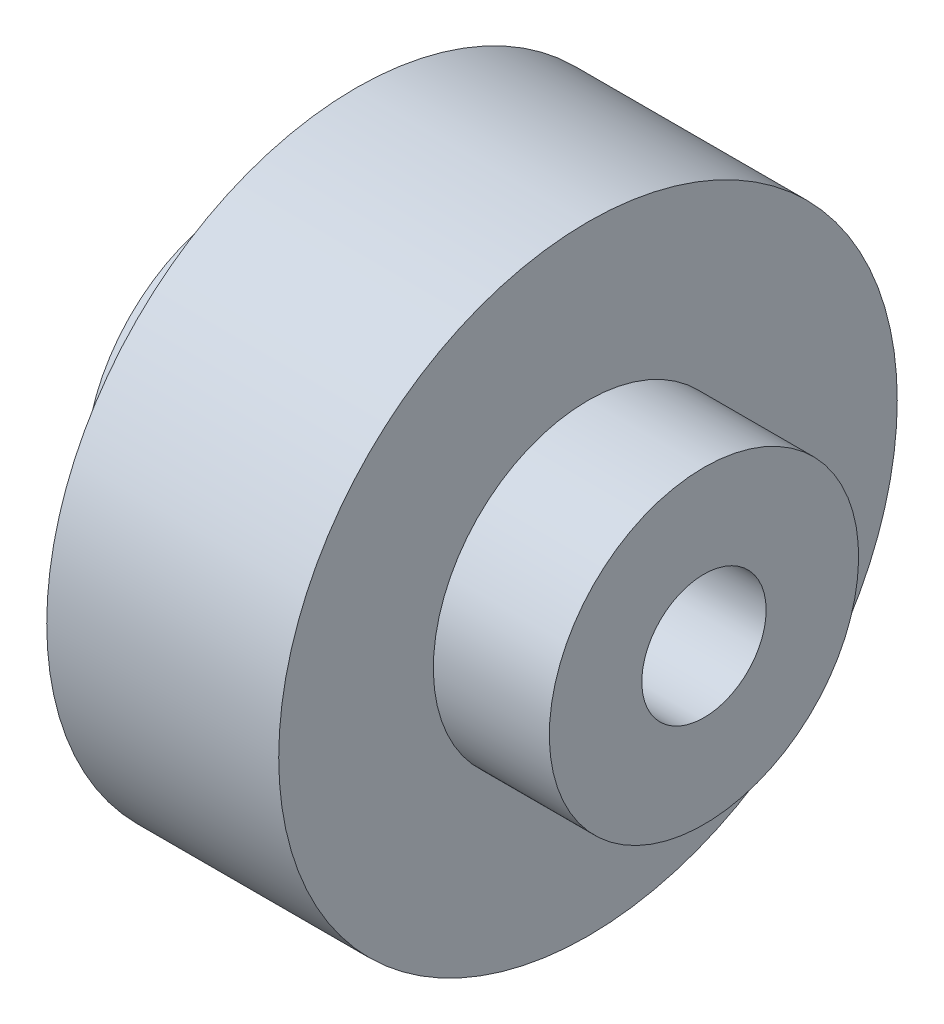
ISO-10303-21;
HEADER;
FILE_DESCRIPTION(('STEP AP214'),'2;1');
FILE_NAME('part.step','',(''),(''),'','','');
FILE_SCHEMA(('AUTOMOTIVE_DESIGN { 1 0 10303 214 1 1 1 1 }'));
ENDSEC;
DATA;
#1=APPLICATION_CONTEXT('core data for automotive mechanical design processes');
#2=APPLICATION_PROTOCOL_DEFINITION('international standard','automotive_design',2000,#1);
#3=PRODUCT_CONTEXT('',#1,'mechanical');
#4=PRODUCT('Part','Part','',(#3));
#5=PRODUCT_RELATED_PRODUCT_CATEGORY('part','',(#4));
#6=PRODUCT_DEFINITION_FORMATION('','',#4);
#7=PRODUCT_DEFINITION_CONTEXT('part definition',#1,'design');
#8=PRODUCT_DEFINITION('design','',#6,#7);
#9=PRODUCT_DEFINITION_SHAPE('','',#8);
#10=(LENGTH_UNIT() NAMED_UNIT(*) SI_UNIT(.MILLI.,.METRE.));
#11=(NAMED_UNIT(*) PLANE_ANGLE_UNIT() SI_UNIT($,.RADIAN.));
#12=(NAMED_UNIT(*) SI_UNIT($,.STERADIAN.) SOLID_ANGLE_UNIT());
#13=UNCERTAINTY_MEASURE_WITH_UNIT(LENGTH_MEASURE(1.E-05),#10,'distance_accuracy_value','');
#14=(GEOMETRIC_REPRESENTATION_CONTEXT(3) GLOBAL_UNCERTAINTY_ASSIGNED_CONTEXT((#13)) GLOBAL_UNIT_ASSIGNED_CONTEXT((#10,
#11,#12)) REPRESENTATION_CONTEXT('',''));
#15=CARTESIAN_POINT('',(0.,0.,0.));
#16=DIRECTION('',(0.,0.,1.));
#17=DIRECTION('',(1.,0.,0.));
#18=AXIS2_PLACEMENT_3D('',#15,#16,#17);
#19=CARTESIAN_POINT('',(0.,0.,0.));
#20=DIRECTION('',(-1.,0.,0.));
#21=DIRECTION('',(0.,-1.,0.));
#22=AXIS2_PLACEMENT_3D('',#19,#20,#21);
#23=PLANE('',#22);
#24=CARTESIAN_POINT('',(0.,0.,0.));
#25=DIRECTION('',(1.,0.,0.));
#26=DIRECTION('',(0.,0.,-1.));
#27=AXIS2_PLACEMENT_3D('',#24,#25,#26);
#28=CIRCLE('',#27,2.5527);
#29=CARTESIAN_POINT('',(0.,0.,-2.5527));
#30=VERTEX_POINT('',#29);
#31=EDGE_CURVE('E78',#30,#30,#28,.T.);
#32=ORIENTED_EDGE('',*,*,#31,.T.);
#33=EDGE_LOOP('',(#32));
#34=FACE_BOUND('',#33,.T.);
#35=CARTESIAN_POINT('',(0.,0.,0.));
#36=DIRECTION('',(1.,0.,0.));
#37=DIRECTION('',(0.,1.,0.));
#38=AXIS2_PLACEMENT_3D('',#35,#36,#37);
#39=CIRCLE('',#38,6.35);
#40=CARTESIAN_POINT('',(0.,6.35,0.));
#41=VERTEX_POINT('',#40);
#42=EDGE_CURVE('E10',#41,#41,#39,.T.);
#43=ORIENTED_EDGE('',*,*,#42,.F.);
#44=EDGE_LOOP('',(#43));
#45=FACE_BOUND('',#44,.T.);
#46=ADVANCED_FACE('F45',(#34,#45),#23,.T.);
#47=CARTESIAN_POINT('',(19.05,0.,0.));
#48=DIRECTION('',(1.,0.,0.));
#49=DIRECTION('',(0.,1.,0.));
#50=AXIS2_PLACEMENT_3D('',#47,#48,#49);
#51=CYLINDRICAL_SURFACE('',#50,6.35);
#52=ORIENTED_EDGE('',*,*,#42,.T.);
#53=EDGE_LOOP('',(#52));
#54=FACE_BOUND('',#53,.T.);
#55=CARTESIAN_POINT('',(4.7625,0.,0.));
#56=DIRECTION('',(1.,0.,0.));
#57=DIRECTION('',(0.,1.,0.));
#58=AXIS2_PLACEMENT_3D('',#55,#56,#57);
#59=CIRCLE('',#58,6.35);
#60=CARTESIAN_POINT('',(4.7625,6.35,0.));
#61=VERTEX_POINT('',#60);
#62=EDGE_CURVE('E52',#61,#61,#59,.T.);
#63=ORIENTED_EDGE('',*,*,#62,.F.);
#64=EDGE_LOOP('',(#63));
#65=FACE_BOUND('',#64,.T.);
#66=ADVANCED_FACE('F108',(#54,#65),#51,.T.);
#67=CARTESIAN_POINT('',(4.7625,6.35,0.));
#68=DIRECTION('',(-1.,0.,0.));
#69=DIRECTION('',(0.,-1.,0.));
#70=AXIS2_PLACEMENT_3D('',#67,#68,#69);
#71=PLANE('',#70);
#72=ORIENTED_EDGE('',*,*,#62,.T.);
#73=EDGE_LOOP('',(#72));
#74=FACE_BOUND('',#73,.T.);
#75=CARTESIAN_POINT('',(4.7625,0.,0.));
#76=DIRECTION('',(1.,0.,0.));
#77=DIRECTION('',(0.,1.,0.));
#78=AXIS2_PLACEMENT_3D('',#75,#76,#77);
#79=CIRCLE('',#78,12.7);
#80=CARTESIAN_POINT('',(4.7625,12.7,0.));
#81=VERTEX_POINT('',#80);
#82=EDGE_CURVE('E58',#81,#81,#79,.T.);
#83=ORIENTED_EDGE('',*,*,#82,.F.);
#84=EDGE_LOOP('',(#83));
#85=FACE_BOUND('',#84,.T.);
#86=ADVANCED_FACE('F113',(#74,#85),#71,.T.);
#87=CARTESIAN_POINT('',(19.05,0.,0.));
#88=DIRECTION('',(1.,0.,0.));
#89=DIRECTION('',(0.,1.,0.));
#90=AXIS2_PLACEMENT_3D('',#87,#88,#89);
#91=CYLINDRICAL_SURFACE('',#90,12.7);
#92=ORIENTED_EDGE('',*,*,#82,.T.);
#93=EDGE_LOOP('',(#92));
#94=FACE_BOUND('',#93,.T.);
#95=CARTESIAN_POINT('',(14.2875,0.,0.));
#96=DIRECTION('',(1.,0.,0.));
#97=DIRECTION('',(0.,1.,0.));
#98=AXIS2_PLACEMENT_3D('',#95,#96,#97);
#99=CIRCLE('',#98,12.7);
#100=CARTESIAN_POINT('',(14.2875,12.7,0.));
#101=VERTEX_POINT('',#100);
#102=EDGE_CURVE('E64',#101,#101,#99,.T.);
#103=ORIENTED_EDGE('',*,*,#102,.F.);
#104=EDGE_LOOP('',(#103));
#105=FACE_BOUND('',#104,.T.);
#106=ADVANCED_FACE('F104',(#94,#105),#91,.T.);
#107=CARTESIAN_POINT('',(14.2875,12.7,0.));
#108=DIRECTION('',(1.,0.,0.));
#109=DIRECTION('',(0.,1.,0.));
#110=AXIS2_PLACEMENT_3D('',#107,#108,#109);
#111=PLANE('',#110);
#112=ORIENTED_EDGE('',*,*,#102,.T.);
#113=EDGE_LOOP('',(#112));
#114=FACE_BOUND('',#113,.T.);
#115=CARTESIAN_POINT('',(14.2875,0.,0.));
#116=DIRECTION('',(1.,0.,0.));
#117=DIRECTION('',(0.,1.,0.));
#118=AXIS2_PLACEMENT_3D('',#115,#116,#117);
#119=CIRCLE('',#118,6.35);
#120=CARTESIAN_POINT('',(14.2875,6.35,0.));
#121=VERTEX_POINT('',#120);
#122=EDGE_CURVE('E70',#121,#121,#119,.T.);
#123=ORIENTED_EDGE('',*,*,#122,.F.);
#124=EDGE_LOOP('',(#123));
#125=FACE_BOUND('',#124,.T.);
#126=ADVANCED_FACE('F98',(#114,#125),#111,.T.);
#127=CARTESIAN_POINT('',(19.05,0.,0.));
#128=DIRECTION('',(1.,0.,0.));
#129=DIRECTION('',(0.,1.,0.));
#130=AXIS2_PLACEMENT_3D('',#127,#128,#129);
#131=CYLINDRICAL_SURFACE('',#130,6.35);
#132=ORIENTED_EDGE('',*,*,#122,.T.);
#133=EDGE_LOOP('',(#132));
#134=FACE_BOUND('',#133,.T.);
#135=CARTESIAN_POINT('',(19.05,0.,0.));
#136=DIRECTION('',(1.,0.,0.));
#137=DIRECTION('',(0.,1.,0.));
#138=AXIS2_PLACEMENT_3D('',#135,#136,#137);
#139=CIRCLE('',#138,6.35);
#140=CARTESIAN_POINT('',(19.05,6.35,0.));
#141=VERTEX_POINT('',#140);
#142=EDGE_CURVE('E74',#141,#141,#139,.T.);
#143=ORIENTED_EDGE('',*,*,#142,.F.);
#144=EDGE_LOOP('',(#143));
#145=FACE_BOUND('',#144,.T.);
#146=ADVANCED_FACE('F93',(#134,#145),#131,.T.);
#147=CARTESIAN_POINT('',(19.05,6.35,0.));
#148=DIRECTION('',(1.,0.,0.));
#149=DIRECTION('',(0.,1.,0.));
#150=AXIS2_PLACEMENT_3D('',#147,#148,#149);
#151=PLANE('',#150);
#152=CARTESIAN_POINT('',(19.05,0.,0.));
#153=DIRECTION('',(1.,0.,0.));
#154=DIRECTION('',(0.,0.,-1.));
#155=AXIS2_PLACEMENT_3D('',#152,#153,#154);
#156=CIRCLE('',#155,2.55269999999999);
#157=CARTESIAN_POINT('',(19.05,0.,-2.55269999999999));
#158=VERTEX_POINT('',#157);
#159=EDGE_CURVE('E82',#158,#158,#156,.T.);
#160=ORIENTED_EDGE('',*,*,#159,.F.);
#161=EDGE_LOOP('',(#160));
#162=FACE_BOUND('',#161,.T.);
#163=ORIENTED_EDGE('',*,*,#142,.T.);
#164=EDGE_LOOP('',(#163));
#165=FACE_BOUND('',#164,.T.);
#166=ADVANCED_FACE('F90',(#162,#165),#151,.T.);
#167=CARTESIAN_POINT('',(19.05,0.,0.));
#168=DIRECTION('',(1.,0.,0.));
#169=DIRECTION('',(0.,0.,-1.));
#170=AXIS2_PLACEMENT_3D('',#167,#168,#169);
#171=CYLINDRICAL_SURFACE('',#170,2.55269999999999);
#172=ORIENTED_EDGE('',*,*,#31,.F.);
#173=EDGE_LOOP('',(#172));
#174=FACE_BOUND('',#173,.T.);
#175=ORIENTED_EDGE('',*,*,#159,.T.);
#176=EDGE_LOOP('',(#175));
#177=FACE_BOUND('',#176,.T.);
#178=ADVANCED_FACE('F88',(#174,#177),#171,.F.);
#179=CLOSED_SHELL('',(#46,#66,#86,#106,#126,#146,#166,#178));
#180=MANIFOLD_SOLID_BREP('B2',#179);
#181=ADVANCED_BREP_SHAPE_REPRESENTATION('',(#18,#180),#14);
#182=SHAPE_DEFINITION_REPRESENTATION(#9,#181);
ENDSEC;
END-ISO-10303-21;
